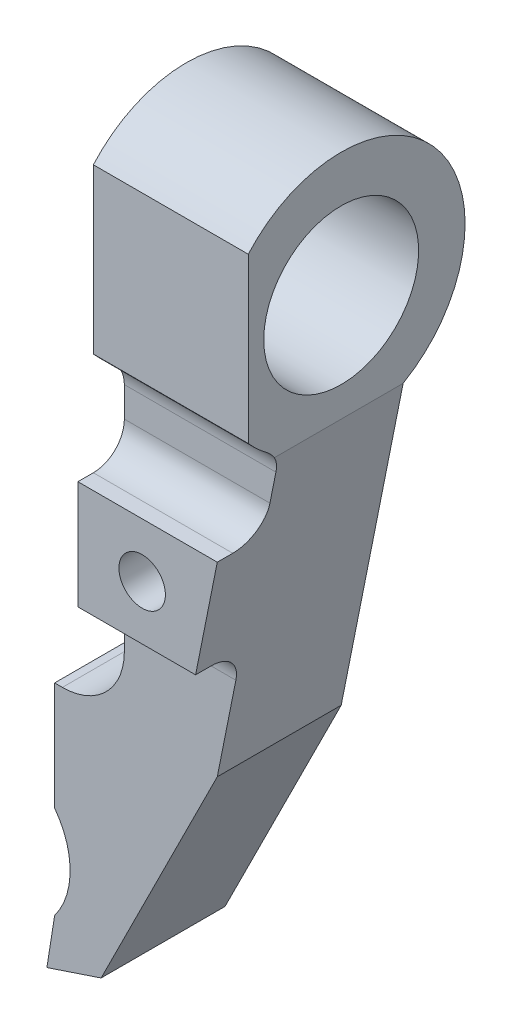
ISO-10303-21;
HEADER;
FILE_DESCRIPTION(('STEP AP214'),'2;1');
FILE_NAME('part.step','',(''),(''),'','','');
FILE_SCHEMA(('AUTOMOTIVE_DESIGN { 1 0 10303 214 1 1 1 1 }'));
ENDSEC;
DATA;
#1=APPLICATION_CONTEXT('core data for automotive mechanical design processes');
#2=APPLICATION_PROTOCOL_DEFINITION('international standard','automotive_design',2000,#1);
#3=PRODUCT_CONTEXT('',#1,'mechanical');
#4=PRODUCT('Part','Part','',(#3));
#5=PRODUCT_RELATED_PRODUCT_CATEGORY('part','',(#4));
#6=PRODUCT_DEFINITION_FORMATION('','',#4);
#7=PRODUCT_DEFINITION_CONTEXT('part definition',#1,'design');
#8=PRODUCT_DEFINITION('design','',#6,#7);
#9=PRODUCT_DEFINITION_SHAPE('','',#8);
#10=(LENGTH_UNIT() NAMED_UNIT(*) SI_UNIT(.MILLI.,.METRE.));
#11=(NAMED_UNIT(*) PLANE_ANGLE_UNIT() SI_UNIT($,.RADIAN.));
#12=(NAMED_UNIT(*) SI_UNIT($,.STERADIAN.) SOLID_ANGLE_UNIT());
#13=UNCERTAINTY_MEASURE_WITH_UNIT(LENGTH_MEASURE(1.E-05),#10,'distance_accuracy_value','');
#14=(GEOMETRIC_REPRESENTATION_CONTEXT(3) GLOBAL_UNCERTAINTY_ASSIGNED_CONTEXT((#13)) GLOBAL_UNIT_ASSIGNED_CONTEXT((#10,
#11,#12)) REPRESENTATION_CONTEXT('',''));
#15=CARTESIAN_POINT('',(0.,0.,0.));
#16=DIRECTION('',(0.,0.,1.));
#17=DIRECTION('',(1.,0.,0.));
#18=AXIS2_PLACEMENT_3D('',#15,#16,#17);
#19=CARTESIAN_POINT('',(0.,0.,8.));
#20=DIRECTION('',(0.,0.,-1.));
#21=DIRECTION('',(-1.,0.,0.));
#22=AXIS2_PLACEMENT_3D('',#19,#20,#21);
#23=PLANE('',#22);
#24=DIRECTION('',(0.196116135138184,0.98058067569092,0.));
#25=VECTOR('',#24,1.);
#26=CARTESIAN_POINT('',(10.,0.,8.));
#27=LINE('',#26,#25);
#28=CARTESIAN_POINT('',(9.4,-3.,8.));
#29=VERTEX_POINT('',#28);
#30=CARTESIAN_POINT('',(9.7856406460551,-1.07179676972449,8.));
#31=VERTEX_POINT('',#30);
#32=EDGE_CURVE('E251',#29,#31,#27,.T.);
#33=ORIENTED_EDGE('',*,*,#32,.T.);
#34=DIRECTION('',(-1.,0.,0.));
#35=VECTOR('',#34,1.);
#36=CARTESIAN_POINT('',(0.,-1.07179676972449,8.));
#37=LINE('',#36,#35);
#38=CARTESIAN_POINT('',(0.,-1.07179676972449,8.));
#39=VERTEX_POINT('',#38);
#40=EDGE_CURVE('E296',#31,#39,#37,.T.);
#41=ORIENTED_EDGE('',*,*,#40,.T.);
#42=DIRECTION('',(0.,-1.,0.));
#43=VECTOR('',#42,1.);
#44=CARTESIAN_POINT('',(0.,-20.,8.));
#45=LINE('',#44,#43);
#46=CARTESIAN_POINT('',(0.,-3.,8.));
#47=VERTEX_POINT('',#46);
#48=EDGE_CURVE('E240',#39,#47,#45,.T.);
#49=ORIENTED_EDGE('',*,*,#48,.T.);
#50=DIRECTION('',(-1.,0.,0.));
#51=VECTOR('',#50,1.);
#52=CARTESIAN_POINT('',(9.,-3.,8.));
#53=LINE('',#52,#51);
#54=EDGE_CURVE('E294',#47,#29,#53,.F.);
#55=ORIENTED_EDGE('',*,*,#54,.T.);
#56=EDGE_LOOP('',(#33,#41,#49,#55));
#57=FACE_BOUND('',#56,.T.);
#58=ADVANCED_FACE('F35',(#57),#23,.F.);
#59=CARTESIAN_POINT('',(6.,-20.,8.));
#60=VERTEX_POINT('',#59);
#61=CARTESIAN_POINT('',(7.2,-14.,8.));
#62=VERTEX_POINT('',#61);
#63=EDGE_CURVE('E252',#60,#62,#27,.T.);
#64=ORIENTED_EDGE('',*,*,#63,.T.);
#65=DIRECTION('',(1.,0.,0.));
#66=VECTOR('',#65,1.);
#67=CARTESIAN_POINT('',(0.,-14.,8.));
#68=LINE('',#67,#66);
#69=CARTESIAN_POINT('',(0.,-14.,8.));
#70=VERTEX_POINT('',#69);
#71=EDGE_CURVE('E305',#62,#70,#68,.F.);
#72=ORIENTED_EDGE('',*,*,#71,.T.);
#73=CARTESIAN_POINT('',(0.,-16.,8.));
#74=VERTEX_POINT('',#73);
#75=EDGE_CURVE('E238',#70,#74,#45,.T.);
#76=ORIENTED_EDGE('',*,*,#75,.T.);
#77=CARTESIAN_POINT('',(-4.,-16.,8.));
#78=DIRECTION('',(0.,0.,-1.));
#79=DIRECTION('',(-1.,0.,0.));
#80=AXIS2_PLACEMENT_3D('',#77,#78,#79);
#81=CIRCLE('',#80,4.);
#82=CARTESIAN_POINT('',(-4.,-20.,8.));
#83=VERTEX_POINT('',#82);
#84=EDGE_CURVE('E287',#74,#83,#81,.T.);
#85=ORIENTED_EDGE('',*,*,#84,.T.);
#86=DIRECTION('',(-1.,0.,0.));
#87=VECTOR('',#86,1.);
#88=CARTESIAN_POINT('',(-4.5,-20.,8.));
#89=LINE('',#88,#87);
#90=CARTESIAN_POINT('',(-4.5,-20.,8.));
#91=VERTEX_POINT('',#90);
#92=EDGE_CURVE('E242',#83,#91,#89,.T.);
#93=ORIENTED_EDGE('',*,*,#92,.T.);
#94=DIRECTION('',(0.,-1.,0.));
#95=VECTOR('',#94,1.);
#96=CARTESIAN_POINT('',(-4.5,-36.,8.));
#97=LINE('',#96,#95);
#98=CARTESIAN_POINT('',(-4.5,-27.,8.));
#99=VERTEX_POINT('',#98);
#100=EDGE_CURVE('E244',#91,#99,#97,.T.);
#101=ORIENTED_EDGE('',*,*,#100,.T.);
#102=CARTESIAN_POINT('',(-8.5,-30.,8.));
#103=DIRECTION('',(0.,0.,1.));
#104=DIRECTION('',(1.,0.,0.));
#105=AXIS2_PLACEMENT_3D('',#102,#103,#104);
#106=CIRCLE('',#105,5.);
#107=CARTESIAN_POINT('',(-4.5,-33.,8.));
#108=VERTEX_POINT('',#107);
#109=EDGE_CURVE('E229',#108,#99,#106,.T.);
#110=ORIENTED_EDGE('',*,*,#109,.F.);
#111=DIRECTION('',(-0.155962573473011,-0.987762965329069,0.));
#112=VECTOR('',#111,1.);
#113=CARTESIAN_POINT('',(-4.5,-33.,8.));
#114=LINE('',#113,#112);
#115=CARTESIAN_POINT('',(-5.,-36.1666666666667,8.));
#116=VERTEX_POINT('',#115);
#117=EDGE_CURVE('E217',#108,#116,#114,.T.);
#118=ORIENTED_EDGE('',*,*,#117,.T.);
#119=DIRECTION('',(0.948683298050514,0.316227766016838,0.));
#120=VECTOR('',#119,1.);
#121=CARTESIAN_POINT('',(-1.5,-35.,8.));
#122=LINE('',#121,#120);
#123=CARTESIAN_POINT('',(-1.5,-35.,8.));
#124=VERTEX_POINT('',#123);
#125=EDGE_CURVE('E247',#116,#124,#122,.T.);
#126=ORIENTED_EDGE('',*,*,#125,.T.);
#127=DIRECTION('',(0.447213595499958,0.894427190999916,0.));
#128=VECTOR('',#127,1.);
#129=CARTESIAN_POINT('',(6.,-20.,8.));
#130=LINE('',#129,#128);
#131=EDGE_CURVE('E249',#124,#60,#130,.T.);
#132=ORIENTED_EDGE('',*,*,#131,.T.);
#133=EDGE_LOOP('',(#64,#72,#76,#85,#93,#101,#110,#118,#126,#132));
#134=FACE_BOUND('',#133,.T.);
#135=ADVANCED_FACE('F363',(#134),#23,.F.);
#136=CARTESIAN_POINT('',(10.,6.92820323027551,4.));
#137=DIRECTION('',(-1.,0.,0.));
#138=DIRECTION('',(0.,0.,1.));
#139=AXIS2_PLACEMENT_3D('',#136,#137,#138);
#140=CYLINDRICAL_SURFACE('',#139,8.);
#141=CARTESIAN_POINT('',(0.,6.92820323027551,4.));
#142=DIRECTION('',(-1.,0.,0.));
#143=DIRECTION('',(0.,0.,1.));
#144=AXIS2_PLACEMENT_3D('',#141,#142,#143);
#145=CIRCLE('',#144,8.);
#146=CARTESIAN_POINT('',(0.,0.528203230275508,8.8));
#147=VERTEX_POINT('',#146);
#148=CARTESIAN_POINT('',(0.,1.63670060814633,10.));
#149=VERTEX_POINT('',#148);
#150=EDGE_CURVE('E219',#147,#149,#145,.T.);
#151=ORIENTED_EDGE('',*,*,#150,.F.);
#152=DIRECTION('',(-1.,0.,0.));
#153=VECTOR('',#152,1.);
#154=CARTESIAN_POINT('',(10.,0.528203230275508,8.8));
#155=LINE('',#154,#153);
#156=CARTESIAN_POINT('',(10.,0.528203230275508,8.8));
#157=VERTEX_POINT('',#156);
#158=EDGE_CURVE('E299',#147,#157,#155,.F.);
#159=ORIENTED_EDGE('',*,*,#158,.T.);
#160=CARTESIAN_POINT('',(10.,6.92820323027551,4.));
#161=DIRECTION('',(-1.,0.,0.));
#162=DIRECTION('',(0.,0.,1.));
#163=AXIS2_PLACEMENT_3D('',#160,#161,#162);
#164=CIRCLE('',#163,8.);
#165=CARTESIAN_POINT('',(10.,1.63670060814633,10.));
#166=VERTEX_POINT('',#165);
#167=EDGE_CURVE('E215',#157,#166,#164,.T.);
#168=ORIENTED_EDGE('',*,*,#167,.T.);
#169=DIRECTION('',(-1.,0.,0.));
#170=VECTOR('',#169,1.);
#171=CARTESIAN_POINT('',(97.6286614344148,1.63670060814633,10.));
#172=LINE('',#171,#170);
#173=EDGE_CURVE('E199',#166,#149,#172,.T.);
#174=ORIENTED_EDGE('',*,*,#173,.T.);
#175=EDGE_LOOP('',(#151,#159,#168,#174));
#176=FACE_BOUND('',#175,.T.);
#177=ADVANCED_FACE('F334',(#176),#140,.T.);
#178=CARTESIAN_POINT('',(-4.5,-36.,8.));
#179=DIRECTION('',(1.,0.,0.));
#180=DIRECTION('',(0.,0.,-1.));
#181=AXIS2_PLACEMENT_3D('',#178,#179,#180);
#182=PLANE('',#181);
#183=DIRECTION('',(0.,-1.,0.));
#184=VECTOR('',#183,1.);
#185=CARTESIAN_POINT('',(-4.5,-36.,0.));
#186=LINE('',#185,#184);
#187=CARTESIAN_POINT('',(-4.5,-20.,0.));
#188=VERTEX_POINT('',#187);
#189=CARTESIAN_POINT('',(-4.5,-27.,0.));
#190=VERTEX_POINT('',#189);
#191=EDGE_CURVE('E258',#188,#190,#186,.T.);
#192=ORIENTED_EDGE('',*,*,#191,.T.);
#193=DIRECTION('',(0.,0.,1.));
#194=VECTOR('',#193,1.);
#195=CARTESIAN_POINT('',(-4.5,-27.,0.));
#196=LINE('',#195,#194);
#197=EDGE_CURVE('E234',#190,#99,#196,.T.);
#198=ORIENTED_EDGE('',*,*,#197,.T.);
#199=ORIENTED_EDGE('',*,*,#100,.F.);
#200=DIRECTION('',(0.,0.,-1.));
#201=VECTOR('',#200,1.);
#202=CARTESIAN_POINT('',(-4.5,-20.,8.));
#203=LINE('',#202,#201);
#204=EDGE_CURVE('E276',#91,#188,#203,.T.);
#205=ORIENTED_EDGE('',*,*,#204,.T.);
#206=EDGE_LOOP('',(#192,#198,#199,#205));
#207=FACE_BOUND('',#206,.T.);
#208=ADVANCED_FACE('F370',(#207),#182,.F.);
#209=CARTESIAN_POINT('',(0.,-20.,8.));
#210=DIRECTION('',(1.,0.,0.));
#211=DIRECTION('',(0.,0.,-1.));
#212=AXIS2_PLACEMENT_3D('',#209,#210,#211);
#213=PLANE('',#212);
#214=ORIENTED_EDGE('',*,*,#48,.F.);
#215=CARTESIAN_POINT('',(0.,-1.07179676972449,10.));
#216=DIRECTION('',(1.,0.,0.));
#217=DIRECTION('',(0.,0.,-1.));
#218=AXIS2_PLACEMENT_3D('',#215,#216,#217);
#219=CIRCLE('',#218,2.);
#220=EDGE_CURVE('E307',#39,#147,#219,.T.);
#221=ORIENTED_EDGE('',*,*,#220,.T.);
#222=ORIENTED_EDGE('',*,*,#150,.T.);
#223=DIRECTION('',(0.,1.,0.));
#224=VECTOR('',#223,1.);
#225=CARTESIAN_POINT('',(0.,-20.,9.99999999999999));
#226=LINE('',#225,#224);
#227=CARTESIAN_POINT('',(0.,12.2197058524047,10.));
#228=VERTEX_POINT('',#227);
#229=EDGE_CURVE('E202',#149,#228,#226,.T.);
#230=ORIENTED_EDGE('',*,*,#229,.T.);
#231=CARTESIAN_POINT('',(0.,0.,0.));
#232=VERTEX_POINT('',#231);
#233=EDGE_CURVE('E212',#228,#232,#145,.T.);
#234=ORIENTED_EDGE('',*,*,#233,.T.);
#235=DIRECTION('',(0.,-1.,0.));
#236=VECTOR('',#235,1.);
#237=CARTESIAN_POINT('',(0.,-20.,0.));
#238=LINE('',#237,#236);
#239=CARTESIAN_POINT('',(0.,-16.,0.));
#240=VERTEX_POINT('',#239);
#241=EDGE_CURVE('E237',#232,#240,#238,.T.);
#242=ORIENTED_EDGE('',*,*,#241,.T.);
#243=DIRECTION('',(0.,0.,-1.));
#244=VECTOR('',#243,1.);
#245=CARTESIAN_POINT('',(0.,-16.,8.));
#246=LINE('',#245,#244);
#247=EDGE_CURVE('E282',#240,#74,#246,.F.);
#248=ORIENTED_EDGE('',*,*,#247,.T.);
#249=ORIENTED_EDGE('',*,*,#75,.F.);
#250=CARTESIAN_POINT('',(0.,-14.,10.));
#251=DIRECTION('',(1.,0.,0.));
#252=DIRECTION('',(0.,0.,-1.));
#253=AXIS2_PLACEMENT_3D('',#250,#251,#252);
#254=CIRCLE('',#253,2.);
#255=CARTESIAN_POINT('',(0.,-12.,10.));
#256=VERTEX_POINT('',#255);
#257=EDGE_CURVE('E12',#70,#256,#254,.T.);
#258=ORIENTED_EDGE('',*,*,#257,.T.);
#259=DIRECTION('',(0.,0.,-1.));
#260=VECTOR('',#259,1.);
#261=CARTESIAN_POINT('',(0.,-12.,33.4017542509914));
#262=LINE('',#261,#260);
#263=CARTESIAN_POINT('',(0.,-12.,11.));
#264=VERTEX_POINT('',#263);
#265=EDGE_CURVE('E187',#264,#256,#262,.T.);
#266=ORIENTED_EDGE('',*,*,#265,.F.);
#267=DIRECTION('',(0.,1.,0.));
#268=VECTOR('',#267,1.);
#269=CARTESIAN_POINT('',(0.,-5.,11.));
#270=LINE('',#269,#268);
#271=CARTESIAN_POINT('',(0.,-5.,11.));
#272=VERTEX_POINT('',#271);
#273=EDGE_CURVE('E171',#264,#272,#270,.T.);
#274=ORIENTED_EDGE('',*,*,#273,.T.);
#275=DIRECTION('',(0.,0.,-1.));
#276=VECTOR('',#275,1.);
#277=CARTESIAN_POINT('',(0.,-5.,33.4017542509914));
#278=LINE('',#277,#276);
#279=CARTESIAN_POINT('',(0.,-5.,10.));
#280=VERTEX_POINT('',#279);
#281=EDGE_CURVE('E181',#272,#280,#278,.T.);
#282=ORIENTED_EDGE('',*,*,#281,.T.);
#283=CARTESIAN_POINT('',(0.,-3.,10.));
#284=DIRECTION('',(1.,0.,0.));
#285=DIRECTION('',(0.,0.,-1.));
#286=AXIS2_PLACEMENT_3D('',#283,#284,#285);
#287=CIRCLE('',#286,2.);
#288=EDGE_CURVE('E313',#280,#47,#287,.T.);
#289=ORIENTED_EDGE('',*,*,#288,.T.);
#290=EDGE_LOOP('',(#214,#221,#222,#230,#234,#242,#248,#249,#258,#266,#274,#282,#289));
#291=FACE_BOUND('',#290,.T.);
#292=CARTESIAN_POINT('',(0.,6.92820323027551,4.));
#293=DIRECTION('',(-1.,0.,0.));
#294=DIRECTION('',(0.,0.,1.));
#295=AXIS2_PLACEMENT_3D('',#292,#293,#294);
#296=CIRCLE('',#295,5.);
#297=CARTESIAN_POINT('',(0.,6.92820323027551,9.));
#298=VERTEX_POINT('',#297);
#299=EDGE_CURVE('E208',#298,#298,#296,.T.);
#300=ORIENTED_EDGE('',*,*,#299,.F.);
#301=EDGE_LOOP('',(#300));
#302=FACE_BOUND('',#301,.T.);
#303=ADVANCED_FACE('F191',(#291,#302),#213,.F.);
#304=CARTESIAN_POINT('',(-4.5,-20.,8.));
#305=DIRECTION('',(0.,-1.,0.));
#306=DIRECTION('',(0.,0.,-1.));
#307=AXIS2_PLACEMENT_3D('',#304,#305,#306);
#308=PLANE('',#307);
#309=ORIENTED_EDGE('',*,*,#92,.F.);
#310=DIRECTION('',(0.,0.,-1.));
#311=VECTOR('',#310,1.);
#312=CARTESIAN_POINT('',(-4.,-20.,0.));
#313=LINE('',#312,#311);
#314=CARTESIAN_POINT('',(-4.,-20.,0.));
#315=VERTEX_POINT('',#314);
#316=EDGE_CURVE('E279',#83,#315,#313,.T.);
#317=ORIENTED_EDGE('',*,*,#316,.T.);
#318=DIRECTION('',(-1.,0.,0.));
#319=VECTOR('',#318,1.);
#320=CARTESIAN_POINT('',(-4.5,-20.,0.));
#321=LINE('',#320,#319);
#322=EDGE_CURVE('E256',#315,#188,#321,.T.);
#323=ORIENTED_EDGE('',*,*,#322,.T.);
#324=ORIENTED_EDGE('',*,*,#204,.F.);
#325=EDGE_LOOP('',(#309,#317,#323,#324));
#326=FACE_BOUND('',#325,.T.);
#327=ADVANCED_FACE('F366',(#326),#308,.F.);
#328=CARTESIAN_POINT('',(-1.5,-35.,8.));
#329=DIRECTION('',(-0.316227766016838,0.948683298050514,0.));
#330=DIRECTION('',(-0.948683298050514,-0.316227766016838,0.));
#331=AXIS2_PLACEMENT_3D('',#328,#329,#330);
#332=PLANE('',#331);
#333=DIRECTION('',(0.948683298050514,0.316227766016838,0.));
#334=VECTOR('',#333,1.);
#335=CARTESIAN_POINT('',(-1.5,-35.,0.));
#336=LINE('',#335,#334);
#337=CARTESIAN_POINT('',(-5.,-36.1666666666667,0.));
#338=VERTEX_POINT('',#337);
#339=CARTESIAN_POINT('',(-1.5,-35.,0.));
#340=VERTEX_POINT('',#339);
#341=EDGE_CURVE('E261',#338,#340,#336,.T.);
#342=ORIENTED_EDGE('',*,*,#341,.T.);
#343=DIRECTION('',(0.,0.,-1.));
#344=VECTOR('',#343,1.);
#345=CARTESIAN_POINT('',(-1.5,-35.,8.));
#346=LINE('',#345,#344);
#347=EDGE_CURVE('E273',#124,#340,#346,.T.);
#348=ORIENTED_EDGE('',*,*,#347,.F.);
#349=ORIENTED_EDGE('',*,*,#125,.F.);
#350=DIRECTION('',(0.,0.,1.));
#351=VECTOR('',#350,1.);
#352=CARTESIAN_POINT('',(-5.,-36.1666666666667,-3.20589734361189));
#353=LINE('',#352,#351);
#354=EDGE_CURVE('E226',#338,#116,#353,.T.);
#355=ORIENTED_EDGE('',*,*,#354,.F.);
#356=EDGE_LOOP('',(#342,#348,#349,#355));
#357=FACE_BOUND('',#356,.T.);
#358=ADVANCED_FACE('F379',(#357),#332,.F.);
#359=CARTESIAN_POINT('',(6.,-20.,8.));
#360=DIRECTION('',(-0.894427190999916,0.447213595499958,0.));
#361=DIRECTION('',(-0.447213595499958,-0.894427190999916,0.));
#362=AXIS2_PLACEMENT_3D('',#359,#360,#361);
#363=PLANE('',#362);
#364=DIRECTION('',(0.447213595499958,0.894427190999916,0.));
#365=VECTOR('',#364,1.);
#366=CARTESIAN_POINT('',(6.,-20.,0.));
#367=LINE('',#366,#365);
#368=CARTESIAN_POINT('',(6.,-20.,0.));
#369=VERTEX_POINT('',#368);
#370=EDGE_CURVE('E263',#340,#369,#367,.T.);
#371=ORIENTED_EDGE('',*,*,#370,.T.);
#372=DIRECTION('',(0.,0.,-1.));
#373=VECTOR('',#372,1.);
#374=CARTESIAN_POINT('',(6.,-20.,8.));
#375=LINE('',#374,#373);
#376=EDGE_CURVE('E270',#60,#369,#375,.T.);
#377=ORIENTED_EDGE('',*,*,#376,.F.);
#378=ORIENTED_EDGE('',*,*,#131,.F.);
#379=ORIENTED_EDGE('',*,*,#347,.T.);
#380=EDGE_LOOP('',(#371,#377,#378,#379));
#381=FACE_BOUND('',#380,.T.);
#382=ADVANCED_FACE('F384',(#381),#363,.F.);
#383=CARTESIAN_POINT('',(10.,0.,8.));
#384=DIRECTION('',(-0.98058067569092,0.196116135138184,0.));
#385=DIRECTION('',(-0.196116135138184,-0.98058067569092,0.));
#386=AXIS2_PLACEMENT_3D('',#383,#384,#385);
#387=PLANE('',#386);
#388=DIRECTION('',(0.196116135138184,0.98058067569092,0.));
#389=VECTOR('',#388,1.);
#390=CARTESIAN_POINT('',(10.,0.,0.));
#391=LINE('',#390,#389);
#392=CARTESIAN_POINT('',(10.,0.,0.));
#393=VERTEX_POINT('',#392);
#394=EDGE_CURVE('E265',#369,#393,#391,.T.);
#395=ORIENTED_EDGE('',*,*,#394,.T.);
#396=DIRECTION('',(0.,0.,-1.));
#397=VECTOR('',#396,1.);
#398=CARTESIAN_POINT('',(10.,0.,8.));
#399=LINE('',#398,#397);
#400=CARTESIAN_POINT('',(10.,0.,8.31143502215398));
#401=VERTEX_POINT('',#400);
#402=EDGE_CURVE('E50',#401,#393,#399,.T.);
#403=ORIENTED_EDGE('',*,*,#402,.F.);
#404=CARTESIAN_POINT('',(9.7856406460551,-1.07179676972449,10.));
#405=DIRECTION('',(-0.98058067569092,0.196116135138184,0.));
#406=DIRECTION('',(-0.196116135138184,-0.98058067569092,0.));
#407=AXIS2_PLACEMENT_3D('',#404,#405,#406);
#408=ELLIPSE('',#407,2.03960780543711,2.);
#409=EDGE_CURVE('E311',#401,#31,#408,.T.);
#410=ORIENTED_EDGE('',*,*,#409,.T.);
#411=ORIENTED_EDGE('',*,*,#32,.F.);
#412=CARTESIAN_POINT('',(9.4,-3.,10.));
#413=DIRECTION('',(-0.98058067569092,0.196116135138184,0.));
#414=DIRECTION('',(0.196116135138184,0.98058067569092,0.));
#415=AXIS2_PLACEMENT_3D('',#412,#413,#414);
#416=ELLIPSE('',#415,2.03960780543711,2.);
#417=CARTESIAN_POINT('',(9.,-5.,10.));
#418=VERTEX_POINT('',#417);
#419=EDGE_CURVE('E315',#29,#418,#416,.T.);
#420=ORIENTED_EDGE('',*,*,#419,.T.);
#421=DIRECTION('',(0.,0.,-1.));
#422=VECTOR('',#421,1.);
#423=CARTESIAN_POINT('',(9.,-5.,33.4017542509914));
#424=LINE('',#423,#422);
#425=CARTESIAN_POINT('',(9.,-5.,11.));
#426=VERTEX_POINT('',#425);
#427=EDGE_CURVE('E186',#426,#418,#424,.T.);
#428=ORIENTED_EDGE('',*,*,#427,.F.);
#429=DIRECTION('',(-0.196116135138184,-0.98058067569092,0.));
#430=VECTOR('',#429,1.);
#431=CARTESIAN_POINT('',(7.6,-12.,11.));
#432=LINE('',#431,#430);
#433=CARTESIAN_POINT('',(7.6,-12.,11.));
#434=VERTEX_POINT('',#433);
#435=EDGE_CURVE('E174',#426,#434,#432,.T.);
#436=ORIENTED_EDGE('',*,*,#435,.T.);
#437=DIRECTION('',(0.,0.,-1.));
#438=VECTOR('',#437,1.);
#439=CARTESIAN_POINT('',(7.6,-12.,33.4017542509914));
#440=LINE('',#439,#438);
#441=CARTESIAN_POINT('',(7.6,-12.,10.));
#442=VERTEX_POINT('',#441);
#443=EDGE_CURVE('E194',#434,#442,#440,.T.);
#444=ORIENTED_EDGE('',*,*,#443,.T.);
#445=CARTESIAN_POINT('',(7.2,-14.,10.));
#446=DIRECTION('',(-0.98058067569092,0.196116135138184,0.));
#447=DIRECTION('',(-0.196116135138184,-0.98058067569092,0.));
#448=AXIS2_PLACEMENT_3D('',#445,#446,#447);
#449=ELLIPSE('',#448,2.03960780543711,2.);
#450=EDGE_CURVE('E43',#442,#62,#449,.T.);
#451=ORIENTED_EDGE('',*,*,#450,.T.);
#452=ORIENTED_EDGE('',*,*,#63,.F.);
#453=ORIENTED_EDGE('',*,*,#376,.T.);
#454=EDGE_LOOP('',(#395,#403,#410,#411,#420,#428,#436,#444,#451,#452,#453));
#455=FACE_BOUND('',#454,.T.);
#456=ADVANCED_FACE('F318',(#455),#387,.F.);
#457=CARTESIAN_POINT('',(0.,0.,0.));
#458=DIRECTION('',(0.,0.,-1.));
#459=DIRECTION('',(-1.,0.,0.));
#460=AXIS2_PLACEMENT_3D('',#457,#458,#459);
#461=PLANE('',#460);
#462=CARTESIAN_POINT('',(4.15,-8.5,0.));
#463=DIRECTION('',(0.,0.,-1.));
#464=DIRECTION('',(-1.,0.,0.));
#465=AXIS2_PLACEMENT_3D('',#462,#463,#464);
#466=CIRCLE('',#465,1.5);
#467=CARTESIAN_POINT('',(2.65,-8.5,0.));
#468=VERTEX_POINT('',#467);
#469=EDGE_CURVE('E433',#468,#468,#466,.T.);
#470=ORIENTED_EDGE('',*,*,#469,.F.);
#471=EDGE_LOOP('',(#470));
#472=FACE_BOUND('',#471,.T.);
#473=CARTESIAN_POINT('',(-8.5,-30.,0.));
#474=DIRECTION('',(0.,0.,-1.));
#475=DIRECTION('',(-1.,0.,0.));
#476=AXIS2_PLACEMENT_3D('',#473,#474,#475);
#477=CIRCLE('',#476,5.);
#478=CARTESIAN_POINT('',(-4.5,-33.,0.));
#479=VERTEX_POINT('',#478);
#480=EDGE_CURVE('E289',#190,#479,#477,.T.);
#481=ORIENTED_EDGE('',*,*,#480,.F.);
#482=ORIENTED_EDGE('',*,*,#191,.F.);
#483=ORIENTED_EDGE('',*,*,#322,.F.);
#484=CARTESIAN_POINT('',(-4.,-16.,0.));
#485=DIRECTION('',(0.,0.,-1.));
#486=DIRECTION('',(-1.,0.,0.));
#487=AXIS2_PLACEMENT_3D('',#484,#485,#486);
#488=CIRCLE('',#487,4.);
#489=EDGE_CURVE('E285',#315,#240,#488,.F.);
#490=ORIENTED_EDGE('',*,*,#489,.T.);
#491=ORIENTED_EDGE('',*,*,#241,.F.);
#492=DIRECTION('',(-1.,0.,0.));
#493=VECTOR('',#492,1.);
#494=CARTESIAN_POINT('',(0.,0.,0.));
#495=LINE('',#494,#493);
#496=EDGE_CURVE('E241',#393,#232,#495,.T.);
#497=ORIENTED_EDGE('',*,*,#496,.F.);
#498=ORIENTED_EDGE('',*,*,#394,.F.);
#499=ORIENTED_EDGE('',*,*,#370,.F.);
#500=ORIENTED_EDGE('',*,*,#341,.F.);
#501=DIRECTION('',(-0.155962573473011,-0.987762965329069,0.));
#502=VECTOR('',#501,1.);
#503=CARTESIAN_POINT('',(-4.5,-33.,0.));
#504=LINE('',#503,#502);
#505=EDGE_CURVE('E223',#479,#338,#504,.T.);
#506=ORIENTED_EDGE('',*,*,#505,.F.);
#507=EDGE_LOOP('',(#481,#482,#483,#490,#491,#497,#498,#499,#500,#506));
#508=FACE_BOUND('',#507,.T.);
#509=ADVANCED_FACE('F353',(#472,#508),#461,.T.);
#510=CARTESIAN_POINT('',(-4.,-16.,8.));
#511=DIRECTION('',(0.,0.,1.));
#512=DIRECTION('',(1.,0.,0.));
#513=AXIS2_PLACEMENT_3D('',#510,#511,#512);
#514=CYLINDRICAL_SURFACE('',#513,4.);
#515=ORIENTED_EDGE('',*,*,#84,.F.);
#516=ORIENTED_EDGE('',*,*,#247,.F.);
#517=ORIENTED_EDGE('',*,*,#489,.F.);
#518=ORIENTED_EDGE('',*,*,#316,.F.);
#519=EDGE_LOOP('',(#515,#516,#517,#518));
#520=FACE_BOUND('',#519,.T.);
#521=ADVANCED_FACE('F359',(#520),#514,.F.);
#522=CARTESIAN_POINT('',(-8.5,-30.,0.));
#523=DIRECTION('',(0.,0.,1.));
#524=DIRECTION('',(1.,0.,0.));
#525=AXIS2_PLACEMENT_3D('',#522,#523,#524);
#526=CYLINDRICAL_SURFACE('',#525,5.);
#527=ORIENTED_EDGE('',*,*,#480,.T.);
#528=DIRECTION('',(0.,0.,1.));
#529=VECTOR('',#528,1.);
#530=CARTESIAN_POINT('',(-4.5,-33.,0.));
#531=LINE('',#530,#529);
#532=EDGE_CURVE('E231',#108,#479,#531,.F.);
#533=ORIENTED_EDGE('',*,*,#532,.F.);
#534=ORIENTED_EDGE('',*,*,#109,.T.);
#535=ORIENTED_EDGE('',*,*,#197,.F.);
#536=EDGE_LOOP('',(#527,#533,#534,#535));
#537=FACE_BOUND('',#536,.T.);
#538=ADVANCED_FACE('F385',(#537),#526,.F.);
#539=CARTESIAN_POINT('',(-4.5,-33.,-3.20589734361189));
#540=DIRECTION('',(-0.987762965329069,0.155962573473011,0.));
#541=DIRECTION('',(-0.155962573473011,-0.987762965329069,0.));
#542=AXIS2_PLACEMENT_3D('',#539,#540,#541);
#543=PLANE('',#542);
#544=ORIENTED_EDGE('',*,*,#532,.T.);
#545=ORIENTED_EDGE('',*,*,#505,.T.);
#546=ORIENTED_EDGE('',*,*,#354,.T.);
#547=ORIENTED_EDGE('',*,*,#117,.F.);
#548=EDGE_LOOP('',(#544,#545,#546,#547));
#549=FACE_BOUND('',#548,.T.);
#550=ADVANCED_FACE('F375',(#549),#543,.T.);
#551=DIRECTION('',(-1.,0.,0.));
#552=VECTOR('',#551,1.);
#553=CARTESIAN_POINT('',(97.6286614344148,12.2197058524047,10.));
#554=LINE('',#553,#552);
#555=CARTESIAN_POINT('',(9.99999999999999,12.2197058524047,10.));
#556=VERTEX_POINT('',#555);
#557=EDGE_CURVE('E203',#556,#228,#554,.T.);
#558=ORIENTED_EDGE('',*,*,#557,.F.);
#559=EDGE_CURVE('E218',#556,#393,#164,.T.);
#560=ORIENTED_EDGE('',*,*,#559,.T.);
#561=ORIENTED_EDGE('',*,*,#496,.T.);
#562=ORIENTED_EDGE('',*,*,#233,.F.);
#563=EDGE_LOOP('',(#558,#560,#561,#562));
#564=FACE_BOUND('',#563,.T.);
#565=ADVANCED_FACE('F344',(#564),#140,.T.);
#566=CARTESIAN_POINT('',(10.,6.92820323027551,4.));
#567=DIRECTION('',(-1.,0.,0.));
#568=DIRECTION('',(0.,0.,1.));
#569=AXIS2_PLACEMENT_3D('',#566,#567,#568);
#570=PLANE('',#569);
#571=CARTESIAN_POINT('',(10.,6.92820323027551,4.));
#572=DIRECTION('',(-1.,0.,0.));
#573=DIRECTION('',(0.,0.,1.));
#574=AXIS2_PLACEMENT_3D('',#571,#572,#573);
#575=CIRCLE('',#574,5.);
#576=CARTESIAN_POINT('',(10.,6.92820323027551,9.));
#577=VERTEX_POINT('',#576);
#578=EDGE_CURVE('E209',#577,#577,#575,.T.);
#579=ORIENTED_EDGE('',*,*,#578,.T.);
#580=EDGE_LOOP('',(#579));
#581=FACE_BOUND('',#580,.T.);
#582=ORIENTED_EDGE('',*,*,#559,.F.);
#583=DIRECTION('',(0.,-1.,0.));
#584=VECTOR('',#583,1.);
#585=CARTESIAN_POINT('',(10.,6.92820323027551,10.));
#586=LINE('',#585,#584);
#587=EDGE_CURVE('E291',#556,#166,#586,.T.);
#588=ORIENTED_EDGE('',*,*,#587,.T.);
#589=ORIENTED_EDGE('',*,*,#167,.F.);
#590=CARTESIAN_POINT('',(10.,-1.07179676972449,10.));
#591=DIRECTION('',(-1.,0.,0.));
#592=DIRECTION('',(0.,0.,1.));
#593=AXIS2_PLACEMENT_3D('',#590,#591,#592);
#594=CIRCLE('',#593,2.);
#595=EDGE_CURVE('E309',#157,#401,#594,.T.);
#596=ORIENTED_EDGE('',*,*,#595,.T.);
#597=ORIENTED_EDGE('',*,*,#402,.T.);
#598=EDGE_LOOP('',(#582,#588,#589,#596,#597));
#599=FACE_BOUND('',#598,.T.);
#600=ADVANCED_FACE('F342',(#581,#599),#570,.F.);
#601=CARTESIAN_POINT('',(10.,6.92820323027551,4.));
#602=DIRECTION('',(-1.,0.,0.));
#603=DIRECTION('',(0.,0.,1.));
#604=AXIS2_PLACEMENT_3D('',#601,#602,#603);
#605=CYLINDRICAL_SURFACE('',#604,5.);
#606=ORIENTED_EDGE('',*,*,#578,.F.);
#607=EDGE_LOOP('',(#606));
#608=FACE_BOUND('',#607,.T.);
#609=ORIENTED_EDGE('',*,*,#299,.T.);
#610=EDGE_LOOP('',(#609));
#611=FACE_BOUND('',#610,.T.);
#612=ADVANCED_FACE('F456',(#608,#611),#605,.F.);
#613=CARTESIAN_POINT('',(97.6286614344148,12.2197058524047,10.));
#614=DIRECTION('',(0.,0.,-1.));
#615=DIRECTION('',(0.,1.,0.));
#616=AXIS2_PLACEMENT_3D('',#613,#614,#615);
#617=PLANE('',#616);
#618=ORIENTED_EDGE('',*,*,#229,.F.);
#619=ORIENTED_EDGE('',*,*,#173,.F.);
#620=ORIENTED_EDGE('',*,*,#587,.F.);
#621=ORIENTED_EDGE('',*,*,#557,.T.);
#622=EDGE_LOOP('',(#618,#619,#620,#621));
#623=FACE_BOUND('',#622,.T.);
#624=ADVANCED_FACE('F338',(#623),#617,.F.);
#625=CARTESIAN_POINT('',(0.,-5.,33.4017542509914));
#626=DIRECTION('',(0.,-1.,0.));
#627=DIRECTION('',(0.,0.,-1.));
#628=AXIS2_PLACEMENT_3D('',#625,#626,#627);
#629=PLANE('',#628);
#630=ORIENTED_EDGE('',*,*,#427,.T.);
#631=DIRECTION('',(-1.,0.,0.));
#632=VECTOR('',#631,1.);
#633=CARTESIAN_POINT('',(0.,-5.,10.));
#634=LINE('',#633,#632);
#635=EDGE_CURVE('E184',#418,#280,#634,.T.);
#636=ORIENTED_EDGE('',*,*,#635,.T.);
#637=ORIENTED_EDGE('',*,*,#281,.F.);
#638=DIRECTION('',(1.,0.,0.));
#639=VECTOR('',#638,1.);
#640=CARTESIAN_POINT('',(0.,-5.,11.));
#641=LINE('',#640,#639);
#642=EDGE_CURVE('E167',#272,#426,#641,.T.);
#643=ORIENTED_EDGE('',*,*,#642,.T.);
#644=EDGE_LOOP('',(#630,#636,#637,#643));
#645=FACE_BOUND('',#644,.T.);
#646=ADVANCED_FACE('F182',(#645),#629,.F.);
#647=CARTESIAN_POINT('',(0.,-12.,33.4017542509914));
#648=DIRECTION('',(0.,1.,0.));
#649=DIRECTION('',(0.,0.,1.));
#650=AXIS2_PLACEMENT_3D('',#647,#648,#649);
#651=PLANE('',#650);
#652=ORIENTED_EDGE('',*,*,#265,.T.);
#653=DIRECTION('',(1.,0.,0.));
#654=VECTOR('',#653,1.);
#655=CARTESIAN_POINT('',(7.6,-12.,10.));
#656=LINE('',#655,#654);
#657=EDGE_CURVE('E302',#256,#442,#656,.T.);
#658=ORIENTED_EDGE('',*,*,#657,.T.);
#659=ORIENTED_EDGE('',*,*,#443,.F.);
#660=DIRECTION('',(-1.,0.,0.));
#661=VECTOR('',#660,1.);
#662=CARTESIAN_POINT('',(0.,-12.,11.));
#663=LINE('',#662,#661);
#664=EDGE_CURVE('E205',#434,#264,#663,.T.);
#665=ORIENTED_EDGE('',*,*,#664,.T.);
#666=EDGE_LOOP('',(#652,#658,#659,#665));
#667=FACE_BOUND('',#666,.T.);
#668=ADVANCED_FACE('F431',(#667),#651,.F.);
#669=CARTESIAN_POINT('',(0.,0.,11.));
#670=DIRECTION('',(0.,0.,-1.));
#671=DIRECTION('',(-1.,0.,0.));
#672=AXIS2_PLACEMENT_3D('',#669,#670,#671);
#673=PLANE('',#672);
#674=CARTESIAN_POINT('',(4.15,-8.5,11.));
#675=DIRECTION('',(0.,0.,1.));
#676=DIRECTION('',(1.,0.,0.));
#677=AXIS2_PLACEMENT_3D('',#674,#675,#676);
#678=CIRCLE('',#677,1.5);
#679=CARTESIAN_POINT('',(5.65,-8.5,11.));
#680=VERTEX_POINT('',#679);
#681=EDGE_CURVE('E436',#680,#680,#678,.T.);
#682=ORIENTED_EDGE('',*,*,#681,.F.);
#683=EDGE_LOOP('',(#682));
#684=FACE_BOUND('',#683,.T.);
#685=ORIENTED_EDGE('',*,*,#435,.F.);
#686=ORIENTED_EDGE('',*,*,#642,.F.);
#687=ORIENTED_EDGE('',*,*,#273,.F.);
#688=ORIENTED_EDGE('',*,*,#664,.F.);
#689=EDGE_LOOP('',(#685,#686,#687,#688));
#690=FACE_BOUND('',#689,.T.);
#691=ADVANCED_FACE('F169',(#684,#690),#673,.F.);
#692=CARTESIAN_POINT('',(10.,-1.07179676972449,10.));
#693=DIRECTION('',(-1.,0.,0.));
#694=DIRECTION('',(0.,0.,1.));
#695=AXIS2_PLACEMENT_3D('',#692,#693,#694);
#696=CYLINDRICAL_SURFACE('',#695,2.);
#697=ORIENTED_EDGE('',*,*,#595,.F.);
#698=ORIENTED_EDGE('',*,*,#158,.F.);
#699=ORIENTED_EDGE('',*,*,#220,.F.);
#700=ORIENTED_EDGE('',*,*,#40,.F.);
#701=ORIENTED_EDGE('',*,*,#409,.F.);
#702=EDGE_LOOP('',(#697,#698,#699,#700,#701));
#703=FACE_BOUND('',#702,.T.);
#704=ADVANCED_FACE('F329',(#703),#696,.F.);
#705=CARTESIAN_POINT('',(0.,-3.,10.));
#706=DIRECTION('',(1.,0.,0.));
#707=DIRECTION('',(0.,0.,-1.));
#708=AXIS2_PLACEMENT_3D('',#705,#706,#707);
#709=CYLINDRICAL_SURFACE('',#708,2.);
#710=ORIENTED_EDGE('',*,*,#419,.F.);
#711=ORIENTED_EDGE('',*,*,#54,.F.);
#712=ORIENTED_EDGE('',*,*,#288,.F.);
#713=ORIENTED_EDGE('',*,*,#635,.F.);
#714=EDGE_LOOP('',(#710,#711,#712,#713));
#715=FACE_BOUND('',#714,.T.);
#716=ADVANCED_FACE('F322',(#715),#709,.F.);
#717=CARTESIAN_POINT('',(0.,-14.,10.));
#718=DIRECTION('',(-1.,0.,0.));
#719=DIRECTION('',(0.,0.,1.));
#720=AXIS2_PLACEMENT_3D('',#717,#718,#719);
#721=CYLINDRICAL_SURFACE('',#720,2.);
#722=ORIENTED_EDGE('',*,*,#257,.F.);
#723=ORIENTED_EDGE('',*,*,#71,.F.);
#724=ORIENTED_EDGE('',*,*,#450,.F.);
#725=ORIENTED_EDGE('',*,*,#657,.F.);
#726=EDGE_LOOP('',(#722,#723,#724,#725));
#727=FACE_BOUND('',#726,.T.);
#728=ADVANCED_FACE('F37',(#727),#721,.F.);
#729=CARTESIAN_POINT('',(4.15,-8.5,-4.));
#730=DIRECTION('',(0.,0.,1.));
#731=DIRECTION('',(1.,0.,0.));
#732=AXIS2_PLACEMENT_3D('',#729,#730,#731);
#733=CYLINDRICAL_SURFACE('',#732,1.5);
#734=ORIENTED_EDGE('',*,*,#469,.T.);
#735=EDGE_LOOP('',(#734));
#736=FACE_BOUND('',#735,.T.);
#737=ORIENTED_EDGE('',*,*,#681,.T.);
#738=EDGE_LOOP('',(#737));
#739=FACE_BOUND('',#738,.T.);
#740=ADVANCED_FACE('F421',(#736,#739),#733,.F.);
#741=CLOSED_SHELL('',(#58,#135,#177,#208,#303,#327,#358,#382,#456,#509,#521,#538,#550,#565,#600,
#612,#624,#646,#668,#691,#704,#716,#728,#740));
#742=MANIFOLD_SOLID_BREP('B2',#741);
#743=ADVANCED_BREP_SHAPE_REPRESENTATION('',(#18,#742),#14);
#744=SHAPE_DEFINITION_REPRESENTATION(#9,#743);
ENDSEC;
END-ISO-10303-21;
